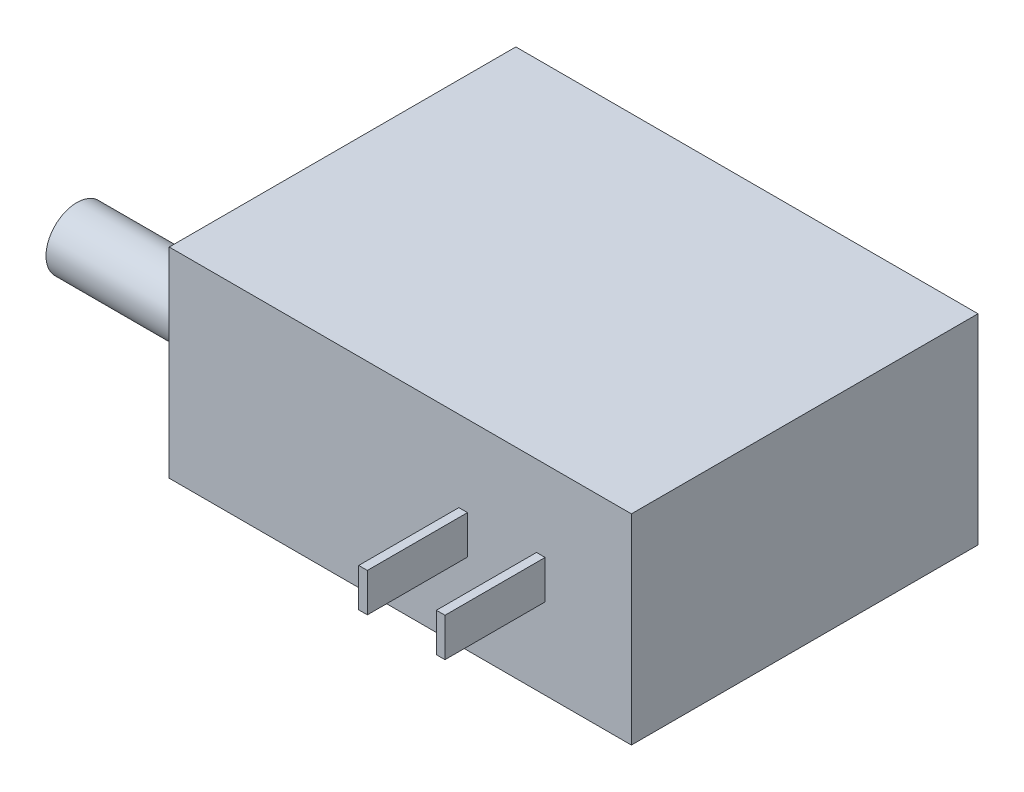
ISO-10303-21;
HEADER;
FILE_DESCRIPTION(('STEP AP214'),'2;1');
FILE_NAME('part.step','',(''),(''),'','','');
FILE_SCHEMA(('AUTOMOTIVE_DESIGN { 1 0 10303 214 1 1 1 1 }'));
ENDSEC;
DATA;
#1=APPLICATION_CONTEXT('core data for automotive mechanical design processes');
#2=APPLICATION_PROTOCOL_DEFINITION('international standard','automotive_design',2000,#1);
#3=PRODUCT_CONTEXT('',#1,'mechanical');
#4=PRODUCT('Part','Part','',(#3));
#5=PRODUCT_RELATED_PRODUCT_CATEGORY('part','',(#4));
#6=PRODUCT_DEFINITION_FORMATION('','',#4);
#7=PRODUCT_DEFINITION_CONTEXT('part definition',#1,'design');
#8=PRODUCT_DEFINITION('design','',#6,#7);
#9=PRODUCT_DEFINITION_SHAPE('','',#8);
#10=(LENGTH_UNIT() NAMED_UNIT(*) SI_UNIT(.MILLI.,.METRE.));
#11=(NAMED_UNIT(*) PLANE_ANGLE_UNIT() SI_UNIT($,.RADIAN.));
#12=(NAMED_UNIT(*) SI_UNIT($,.STERADIAN.) SOLID_ANGLE_UNIT());
#13=UNCERTAINTY_MEASURE_WITH_UNIT(LENGTH_MEASURE(1.E-05),#10,'distance_accuracy_value','');
#14=(GEOMETRIC_REPRESENTATION_CONTEXT(3) GLOBAL_UNCERTAINTY_ASSIGNED_CONTEXT((#13)) GLOBAL_UNIT_ASSIGNED_CONTEXT((#10,
#11,#12)) REPRESENTATION_CONTEXT('',''));
#15=CARTESIAN_POINT('',(0.,0.,0.));
#16=DIRECTION('',(0.,0.,1.));
#17=DIRECTION('',(1.,0.,0.));
#18=AXIS2_PLACEMENT_3D('',#15,#16,#17);
#19=CARTESIAN_POINT('',(-38.1,33.02,28.575));
#20=DIRECTION('',(0.,0.,-1.));
#21=DIRECTION('',(-1.,0.,0.));
#22=AXIS2_PLACEMENT_3D('',#19,#20,#21);
#23=PLANE('',#22);
#24=DIRECTION('',(0.,1.,0.));
#25=VECTOR('',#24,1.);
#26=CARTESIAN_POINT('',(23.876,19.685,28.575));
#27=LINE('',#26,#25);
#28=CARTESIAN_POINT('',(23.876,13.335,28.575));
#29=VERTEX_POINT('',#28);
#30=CARTESIAN_POINT('',(23.876,19.685,28.575));
#31=VERTEX_POINT('',#30);
#32=EDGE_CURVE('E143',#29,#31,#27,.T.);
#33=ORIENTED_EDGE('',*,*,#32,.F.);
#34=DIRECTION('',(1.,0.,0.));
#35=VECTOR('',#34,1.);
#36=CARTESIAN_POINT('',(23.876,13.335,28.575));
#37=LINE('',#36,#35);
#38=CARTESIAN_POINT('',(22.4536,13.335,28.575));
#39=VERTEX_POINT('',#38);
#40=EDGE_CURVE('E156',#39,#29,#37,.T.);
#41=ORIENTED_EDGE('',*,*,#40,.F.);
#42=DIRECTION('',(0.,-1.,0.));
#43=VECTOR('',#42,1.);
#44=CARTESIAN_POINT('',(22.4536,19.685,28.575));
#45=LINE('',#44,#43);
#46=CARTESIAN_POINT('',(22.4536,19.685,28.575));
#47=VERTEX_POINT('',#46);
#48=EDGE_CURVE('E165',#47,#39,#45,.T.);
#49=ORIENTED_EDGE('',*,*,#48,.F.);
#50=DIRECTION('',(-1.,0.,0.));
#51=VECTOR('',#50,1.);
#52=CARTESIAN_POINT('',(23.876,19.685,28.575));
#53=LINE('',#52,#51);
#54=EDGE_CURVE('E146',#31,#47,#53,.T.);
#55=ORIENTED_EDGE('',*,*,#54,.F.);
#56=EDGE_LOOP('',(#33,#41,#49,#55));
#57=FACE_BOUND('',#56,.T.);
#58=DIRECTION('',(1.,0.,0.));
#59=VECTOR('',#58,1.);
#60=CARTESIAN_POINT('',(-38.1,0.,28.575));
#61=LINE('',#60,#59);
#62=CARTESIAN_POINT('',(-38.1,0.,28.575));
#63=VERTEX_POINT('',#62);
#64=CARTESIAN_POINT('',(38.1,0.,28.575));
#65=VERTEX_POINT('',#64);
#66=EDGE_CURVE('E198',#63,#65,#61,.T.);
#67=ORIENTED_EDGE('',*,*,#66,.T.);
#68=DIRECTION('',(0.,-1.,0.));
#69=VECTOR('',#68,1.);
#70=CARTESIAN_POINT('',(38.1,33.02,28.575));
#71=LINE('',#70,#69);
#72=CARTESIAN_POINT('',(38.1,33.02,28.575));
#73=VERTEX_POINT('',#72);
#74=EDGE_CURVE('E208',#73,#65,#71,.T.);
#75=ORIENTED_EDGE('',*,*,#74,.F.);
#76=DIRECTION('',(1.,0.,0.));
#77=VECTOR('',#76,1.);
#78=CARTESIAN_POINT('',(-38.1,33.02,28.575));
#79=LINE('',#78,#77);
#80=CARTESIAN_POINT('',(-38.1,33.02,28.575));
#81=VERTEX_POINT('',#80);
#82=EDGE_CURVE('E188',#81,#73,#79,.T.);
#83=ORIENTED_EDGE('',*,*,#82,.F.);
#84=DIRECTION('',(0.,-1.,0.));
#85=VECTOR('',#84,1.);
#86=CARTESIAN_POINT('',(-38.1,33.02,28.575));
#87=LINE('',#86,#85);
#88=EDGE_CURVE('E41',#81,#63,#87,.T.);
#89=ORIENTED_EDGE('',*,*,#88,.T.);
#90=EDGE_LOOP('',(#67,#75,#83,#89));
#91=FACE_BOUND('',#90,.T.);
#92=DIRECTION('',(0.,1.,0.));
#93=VECTOR('',#92,1.);
#94=CARTESIAN_POINT('',(11.0744,19.685,28.575));
#95=LINE('',#94,#93);
#96=CARTESIAN_POINT('',(11.0744,13.335,28.575));
#97=VERTEX_POINT('',#96);
#98=CARTESIAN_POINT('',(11.0744,19.685,28.575));
#99=VERTEX_POINT('',#98);
#100=EDGE_CURVE('E142',#97,#99,#95,.T.);
#101=ORIENTED_EDGE('',*,*,#100,.F.);
#102=DIRECTION('',(1.,0.,0.));
#103=VECTOR('',#102,1.);
#104=CARTESIAN_POINT('',(11.0744,13.335,28.575));
#105=LINE('',#104,#103);
#106=CARTESIAN_POINT('',(9.65200000000002,13.335,28.575));
#107=VERTEX_POINT('',#106);
#108=EDGE_CURVE('E139',#107,#97,#105,.T.);
#109=ORIENTED_EDGE('',*,*,#108,.F.);
#110=DIRECTION('',(0.,-1.,0.));
#111=VECTOR('',#110,1.);
#112=CARTESIAN_POINT('',(9.65200000000002,19.685,28.575));
#113=LINE('',#112,#111);
#114=CARTESIAN_POINT('',(9.65200000000002,19.685,28.575));
#115=VERTEX_POINT('',#114);
#116=EDGE_CURVE('E53',#115,#107,#113,.T.);
#117=ORIENTED_EDGE('',*,*,#116,.F.);
#118=DIRECTION('',(-1.,0.,0.));
#119=VECTOR('',#118,1.);
#120=CARTESIAN_POINT('',(11.0744,19.685,28.575));
#121=LINE('',#120,#119);
#122=EDGE_CURVE('E48',#99,#115,#121,.T.);
#123=ORIENTED_EDGE('',*,*,#122,.F.);
#124=EDGE_LOOP('',(#101,#109,#117,#123));
#125=FACE_BOUND('',#124,.T.);
#126=ADVANCED_FACE('F33',(#57,#91,#125),#23,.F.);
#127=CARTESIAN_POINT('',(-38.1,33.02,-28.575));
#128=DIRECTION('',(1.,0.,0.));
#129=DIRECTION('',(0.,0.,-1.));
#130=AXIS2_PLACEMENT_3D('',#127,#128,#129);
#131=PLANE('',#130);
#132=DIRECTION('',(0.,0.,1.));
#133=VECTOR('',#132,1.);
#134=CARTESIAN_POINT('',(-38.1,0.,-28.575));
#135=LINE('',#134,#133);
#136=CARTESIAN_POINT('',(-38.1,0.,-28.575));
#137=VERTEX_POINT('',#136);
#138=EDGE_CURVE('E184',#137,#63,#135,.T.);
#139=ORIENTED_EDGE('',*,*,#138,.T.);
#140=ORIENTED_EDGE('',*,*,#88,.F.);
#141=DIRECTION('',(0.,0.,1.));
#142=VECTOR('',#141,1.);
#143=CARTESIAN_POINT('',(-38.1,33.02,-28.575));
#144=LINE('',#143,#142);
#145=CARTESIAN_POINT('',(-38.1,33.02,-28.575));
#146=VERTEX_POINT('',#145);
#147=EDGE_CURVE('E185',#146,#81,#144,.T.);
#148=ORIENTED_EDGE('',*,*,#147,.F.);
#149=DIRECTION('',(0.,-1.,0.));
#150=VECTOR('',#149,1.);
#151=CARTESIAN_POINT('',(-38.1,33.02,-28.575));
#152=LINE('',#151,#150);
#153=EDGE_CURVE('E195',#146,#137,#152,.T.);
#154=ORIENTED_EDGE('',*,*,#153,.T.);
#155=EDGE_LOOP('',(#139,#140,#148,#154));
#156=FACE_BOUND('',#155,.T.);
#157=CARTESIAN_POINT('',(-38.1,16.51,18.415));
#158=DIRECTION('',(1.,0.,0.));
#159=DIRECTION('',(0.,0.,-1.));
#160=AXIS2_PLACEMENT_3D('',#157,#158,#159);
#161=CIRCLE('',#160,5.08);
#162=CARTESIAN_POINT('',(-38.1,16.51,13.335));
#163=VERTEX_POINT('',#162);
#164=EDGE_CURVE('E11',#163,#163,#161,.F.);
#165=ORIENTED_EDGE('',*,*,#164,.F.);
#166=EDGE_LOOP('',(#165));
#167=FACE_BOUND('',#166,.T.);
#168=ADVANCED_FACE('F35',(#156,#167),#131,.F.);
#169=CARTESIAN_POINT('',(38.1,33.02,-28.575));
#170=DIRECTION('',(-1.,0.,0.));
#171=DIRECTION('',(0.,0.,1.));
#172=AXIS2_PLACEMENT_3D('',#169,#170,#171);
#173=PLANE('',#172);
#174=DIRECTION('',(0.,0.,-1.));
#175=VECTOR('',#174,1.);
#176=CARTESIAN_POINT('',(38.1,0.,-28.575));
#177=LINE('',#176,#175);
#178=CARTESIAN_POINT('',(38.1,0.,-28.575));
#179=VERTEX_POINT('',#178);
#180=EDGE_CURVE('E200',#65,#179,#177,.T.);
#181=ORIENTED_EDGE('',*,*,#180,.T.);
#182=DIRECTION('',(0.,-1.,0.));
#183=VECTOR('',#182,1.);
#184=CARTESIAN_POINT('',(38.1,33.02,-28.575));
#185=LINE('',#184,#183);
#186=CARTESIAN_POINT('',(38.1,33.02,-28.575));
#187=VERTEX_POINT('',#186);
#188=EDGE_CURVE('E205',#187,#179,#185,.T.);
#189=ORIENTED_EDGE('',*,*,#188,.F.);
#190=DIRECTION('',(0.,0.,-1.));
#191=VECTOR('',#190,1.);
#192=CARTESIAN_POINT('',(38.1,33.02,-28.575));
#193=LINE('',#192,#191);
#194=EDGE_CURVE('E191',#73,#187,#193,.T.);
#195=ORIENTED_EDGE('',*,*,#194,.F.);
#196=ORIENTED_EDGE('',*,*,#74,.T.);
#197=EDGE_LOOP('',(#181,#189,#195,#196));
#198=FACE_BOUND('',#197,.T.);
#199=ADVANCED_FACE('F225',(#198),#173,.F.);
#200=CARTESIAN_POINT('',(-38.1,33.02,-28.575));
#201=DIRECTION('',(0.,0.,1.));
#202=DIRECTION('',(1.,0.,0.));
#203=AXIS2_PLACEMENT_3D('',#200,#201,#202);
#204=PLANE('',#203);
#205=DIRECTION('',(-1.,0.,0.));
#206=VECTOR('',#205,1.);
#207=CARTESIAN_POINT('',(-38.1,0.,-28.575));
#208=LINE('',#207,#206);
#209=EDGE_CURVE('E189',#179,#137,#208,.T.);
#210=ORIENTED_EDGE('',*,*,#209,.T.);
#211=ORIENTED_EDGE('',*,*,#153,.F.);
#212=DIRECTION('',(-1.,0.,0.));
#213=VECTOR('',#212,1.);
#214=CARTESIAN_POINT('',(-38.1,33.02,-28.575));
#215=LINE('',#214,#213);
#216=EDGE_CURVE('E193',#187,#146,#215,.T.);
#217=ORIENTED_EDGE('',*,*,#216,.F.);
#218=ORIENTED_EDGE('',*,*,#188,.T.);
#219=EDGE_LOOP('',(#210,#211,#217,#218));
#220=FACE_BOUND('',#219,.T.);
#221=ADVANCED_FACE('F229',(#220),#204,.F.);
#222=CARTESIAN_POINT('',(0.,33.02,0.));
#223=DIRECTION('',(0.,1.,0.));
#224=DIRECTION('',(0.,0.,1.));
#225=AXIS2_PLACEMENT_3D('',#222,#223,#224);
#226=PLANE('',#225);
#227=ORIENTED_EDGE('',*,*,#147,.T.);
#228=ORIENTED_EDGE('',*,*,#82,.T.);
#229=ORIENTED_EDGE('',*,*,#194,.T.);
#230=ORIENTED_EDGE('',*,*,#216,.T.);
#231=EDGE_LOOP('',(#227,#228,#229,#230));
#232=FACE_BOUND('',#231,.T.);
#233=ADVANCED_FACE('F231',(#232),#226,.T.);
#234=CARTESIAN_POINT('',(0.,0.,0.));
#235=DIRECTION('',(0.,1.,0.));
#236=DIRECTION('',(0.,0.,1.));
#237=AXIS2_PLACEMENT_3D('',#234,#235,#236);
#238=PLANE('',#237);
#239=ORIENTED_EDGE('',*,*,#138,.F.);
#240=ORIENTED_EDGE('',*,*,#209,.F.);
#241=ORIENTED_EDGE('',*,*,#180,.F.);
#242=ORIENTED_EDGE('',*,*,#66,.F.);
#243=EDGE_LOOP('',(#239,#240,#241,#242));
#244=FACE_BOUND('',#243,.T.);
#245=ADVANCED_FACE('F221',(#244),#238,.F.);
#246=CARTESIAN_POINT('',(-63.5,16.51,18.415));
#247=DIRECTION('',(1.,0.,0.));
#248=DIRECTION('',(0.,0.,-1.));
#249=AXIS2_PLACEMENT_3D('',#246,#247,#248);
#250=CYLINDRICAL_SURFACE('',#249,5.08);
#251=CARTESIAN_POINT('',(-63.5,16.51,18.415));
#252=DIRECTION('',(-1.,0.,0.));
#253=DIRECTION('',(0.,0.,1.));
#254=AXIS2_PLACEMENT_3D('',#251,#252,#253);
#255=CIRCLE('',#254,5.08);
#256=CARTESIAN_POINT('',(-63.5,16.51,23.495));
#257=VERTEX_POINT('',#256);
#258=EDGE_CURVE('E181',#257,#257,#255,.T.);
#259=ORIENTED_EDGE('',*,*,#258,.F.);
#260=EDGE_LOOP('',(#259));
#261=FACE_BOUND('',#260,.T.);
#262=ORIENTED_EDGE('',*,*,#164,.T.);
#263=EDGE_LOOP('',(#262));
#264=FACE_BOUND('',#263,.T.);
#265=ADVANCED_FACE('F238',(#261,#264),#250,.T.);
#266=CARTESIAN_POINT('',(-63.5,16.51,18.415));
#267=DIRECTION('',(-1.,0.,0.));
#268=DIRECTION('',(0.,0.,1.));
#269=AXIS2_PLACEMENT_3D('',#266,#267,#268);
#270=PLANE('',#269);
#271=ORIENTED_EDGE('',*,*,#258,.T.);
#272=EDGE_LOOP('',(#271));
#273=FACE_BOUND('',#272,.T.);
#274=ADVANCED_FACE('F280',(#273),#270,.T.);
#275=CARTESIAN_POINT('',(23.876,19.685,45.085));
#276=DIRECTION('',(-1.,0.,0.));
#277=DIRECTION('',(0.,0.,1.));
#278=AXIS2_PLACEMENT_3D('',#275,#276,#277);
#279=PLANE('',#278);
#280=ORIENTED_EDGE('',*,*,#32,.T.);
#281=DIRECTION('',(0.,0.,-1.));
#282=VECTOR('',#281,1.);
#283=CARTESIAN_POINT('',(23.876,19.685,45.085));
#284=LINE('',#283,#282);
#285=CARTESIAN_POINT('',(23.876,19.685,45.085));
#286=VERTEX_POINT('',#285);
#287=EDGE_CURVE('E178',#286,#31,#284,.T.);
#288=ORIENTED_EDGE('',*,*,#287,.F.);
#289=DIRECTION('',(0.,1.,0.));
#290=VECTOR('',#289,1.);
#291=CARTESIAN_POINT('',(23.876,19.685,45.085));
#292=LINE('',#291,#290);
#293=CARTESIAN_POINT('',(23.876,13.335,45.085));
#294=VERTEX_POINT('',#293);
#295=EDGE_CURVE('E152',#294,#286,#292,.T.);
#296=ORIENTED_EDGE('',*,*,#295,.F.);
#297=DIRECTION('',(0.,0.,-1.));
#298=VECTOR('',#297,1.);
#299=CARTESIAN_POINT('',(23.876,13.335,45.085));
#300=LINE('',#299,#298);
#301=EDGE_CURVE('E161',#294,#29,#300,.T.);
#302=ORIENTED_EDGE('',*,*,#301,.T.);
#303=EDGE_LOOP('',(#280,#288,#296,#302));
#304=FACE_BOUND('',#303,.T.);
#305=ADVANCED_FACE('F288',(#304),#279,.F.);
#306=CARTESIAN_POINT('',(23.876,19.685,45.085));
#307=DIRECTION('',(0.,-1.,0.));
#308=DIRECTION('',(0.,0.,-1.));
#309=AXIS2_PLACEMENT_3D('',#306,#307,#308);
#310=PLANE('',#309);
#311=ORIENTED_EDGE('',*,*,#54,.T.);
#312=DIRECTION('',(0.,0.,-1.));
#313=VECTOR('',#312,1.);
#314=CARTESIAN_POINT('',(22.4536,19.685,45.085));
#315=LINE('',#314,#313);
#316=CARTESIAN_POINT('',(22.4536,19.685,45.085));
#317=VERTEX_POINT('',#316);
#318=EDGE_CURVE('E175',#317,#47,#315,.T.);
#319=ORIENTED_EDGE('',*,*,#318,.F.);
#320=DIRECTION('',(-1.,0.,0.));
#321=VECTOR('',#320,1.);
#322=CARTESIAN_POINT('',(23.876,19.685,45.085));
#323=LINE('',#322,#321);
#324=EDGE_CURVE('E155',#286,#317,#323,.T.);
#325=ORIENTED_EDGE('',*,*,#324,.F.);
#326=ORIENTED_EDGE('',*,*,#287,.T.);
#327=EDGE_LOOP('',(#311,#319,#325,#326));
#328=FACE_BOUND('',#327,.T.);
#329=ADVANCED_FACE('F303',(#328),#310,.F.);
#330=CARTESIAN_POINT('',(22.4536,19.685,45.085));
#331=DIRECTION('',(1.,0.,0.));
#332=DIRECTION('',(0.,0.,-1.));
#333=AXIS2_PLACEMENT_3D('',#330,#331,#332);
#334=PLANE('',#333);
#335=ORIENTED_EDGE('',*,*,#48,.T.);
#336=DIRECTION('',(0.,0.,-1.));
#337=VECTOR('',#336,1.);
#338=CARTESIAN_POINT('',(22.4536,13.335,45.085));
#339=LINE('',#338,#337);
#340=CARTESIAN_POINT('',(22.4536,13.335,45.085));
#341=VERTEX_POINT('',#340);
#342=EDGE_CURVE('E172',#341,#39,#339,.T.);
#343=ORIENTED_EDGE('',*,*,#342,.F.);
#344=DIRECTION('',(0.,-1.,0.));
#345=VECTOR('',#344,1.);
#346=CARTESIAN_POINT('',(22.4536,19.685,45.085));
#347=LINE('',#346,#345);
#348=EDGE_CURVE('E158',#317,#341,#347,.T.);
#349=ORIENTED_EDGE('',*,*,#348,.F.);
#350=ORIENTED_EDGE('',*,*,#318,.T.);
#351=EDGE_LOOP('',(#335,#343,#349,#350));
#352=FACE_BOUND('',#351,.T.);
#353=ADVANCED_FACE('F313',(#352),#334,.F.);
#354=CARTESIAN_POINT('',(23.876,13.335,45.085));
#355=DIRECTION('',(0.,1.,0.));
#356=DIRECTION('',(0.,0.,1.));
#357=AXIS2_PLACEMENT_3D('',#354,#355,#356);
#358=PLANE('',#357);
#359=ORIENTED_EDGE('',*,*,#40,.T.);
#360=ORIENTED_EDGE('',*,*,#301,.F.);
#361=DIRECTION('',(1.,0.,0.));
#362=VECTOR('',#361,1.);
#363=CARTESIAN_POINT('',(23.876,13.335,45.085));
#364=LINE('',#363,#362);
#365=EDGE_CURVE('E160',#341,#294,#364,.T.);
#366=ORIENTED_EDGE('',*,*,#365,.F.);
#367=ORIENTED_EDGE('',*,*,#342,.T.);
#368=EDGE_LOOP('',(#359,#360,#366,#367));
#369=FACE_BOUND('',#368,.T.);
#370=ADVANCED_FACE('F323',(#369),#358,.F.);
#371=CARTESIAN_POINT('',(0.,0.,45.085));
#372=DIRECTION('',(0.,0.,-1.));
#373=DIRECTION('',(-1.,0.,0.));
#374=AXIS2_PLACEMENT_3D('',#371,#372,#373);
#375=PLANE('',#374);
#376=ORIENTED_EDGE('',*,*,#295,.T.);
#377=ORIENTED_EDGE('',*,*,#324,.T.);
#378=ORIENTED_EDGE('',*,*,#348,.T.);
#379=ORIENTED_EDGE('',*,*,#365,.T.);
#380=EDGE_LOOP('',(#376,#377,#378,#379));
#381=FACE_BOUND('',#380,.T.);
#382=ADVANCED_FACE('F333',(#381),#375,.F.);
#383=CARTESIAN_POINT('',(11.0744,19.685,45.085));
#384=DIRECTION('',(-1.,0.,0.));
#385=DIRECTION('',(0.,-1.,0.));
#386=AXIS2_PLACEMENT_3D('',#383,#384,#385);
#387=PLANE('',#386);
#388=ORIENTED_EDGE('',*,*,#100,.T.);
#389=DIRECTION('',(0.,0.,-1.));
#390=VECTOR('',#389,1.);
#391=CARTESIAN_POINT('',(11.0744,19.685,45.085));
#392=LINE('',#391,#390);
#393=CARTESIAN_POINT('',(11.0744,19.685,45.085));
#394=VERTEX_POINT('',#393);
#395=EDGE_CURVE('E123',#394,#99,#392,.T.);
#396=ORIENTED_EDGE('',*,*,#395,.F.);
#397=DIRECTION('',(0.,1.,0.));
#398=VECTOR('',#397,1.);
#399=CARTESIAN_POINT('',(11.0744,19.685,45.085));
#400=LINE('',#399,#398);
#401=CARTESIAN_POINT('',(11.0744,13.335,45.085));
#402=VERTEX_POINT('',#401);
#403=EDGE_CURVE('E130',#402,#394,#400,.T.);
#404=ORIENTED_EDGE('',*,*,#403,.F.);
#405=DIRECTION('',(0.,0.,-1.));
#406=VECTOR('',#405,1.);
#407=CARTESIAN_POINT('',(11.0744,13.335,45.085));
#408=LINE('',#407,#406);
#409=EDGE_CURVE('E393',#402,#97,#408,.T.);
#410=ORIENTED_EDGE('',*,*,#409,.T.);
#411=EDGE_LOOP('',(#388,#396,#404,#410));
#412=FACE_BOUND('',#411,.T.);
#413=ADVANCED_FACE('F141',(#412),#387,.F.);
#414=CARTESIAN_POINT('',(11.0744,19.685,45.085));
#415=DIRECTION('',(0.,-1.,0.));
#416=DIRECTION('',(0.,0.,-1.));
#417=AXIS2_PLACEMENT_3D('',#414,#415,#416);
#418=PLANE('',#417);
#419=ORIENTED_EDGE('',*,*,#122,.T.);
#420=DIRECTION('',(0.,0.,-1.));
#421=VECTOR('',#420,1.);
#422=CARTESIAN_POINT('',(9.65200000000002,19.685,45.085));
#423=LINE('',#422,#421);
#424=CARTESIAN_POINT('',(9.65200000000002,19.685,45.085));
#425=VERTEX_POINT('',#424);
#426=EDGE_CURVE('E126',#425,#115,#423,.T.);
#427=ORIENTED_EDGE('',*,*,#426,.F.);
#428=DIRECTION('',(-1.,0.,0.));
#429=VECTOR('',#428,1.);
#430=CARTESIAN_POINT('',(11.0744,19.685,45.085));
#431=LINE('',#430,#429);
#432=EDGE_CURVE('E119',#394,#425,#431,.T.);
#433=ORIENTED_EDGE('',*,*,#432,.F.);
#434=ORIENTED_EDGE('',*,*,#395,.T.);
#435=EDGE_LOOP('',(#419,#427,#433,#434));
#436=FACE_BOUND('',#435,.T.);
#437=ADVANCED_FACE('F121',(#436),#418,.F.);
#438=CARTESIAN_POINT('',(9.65200000000002,19.685,45.085));
#439=DIRECTION('',(1.,0.,0.));
#440=DIRECTION('',(0.,0.,-1.));
#441=AXIS2_PLACEMENT_3D('',#438,#439,#440);
#442=PLANE('',#441);
#443=ORIENTED_EDGE('',*,*,#116,.T.);
#444=DIRECTION('',(0.,0.,-1.));
#445=VECTOR('',#444,1.);
#446=CARTESIAN_POINT('',(9.65200000000002,13.335,45.085));
#447=LINE('',#446,#445);
#448=CARTESIAN_POINT('',(9.65200000000002,13.335,45.085));
#449=VERTEX_POINT('',#448);
#450=EDGE_CURVE('E148',#449,#107,#447,.T.);
#451=ORIENTED_EDGE('',*,*,#450,.F.);
#452=DIRECTION('',(0.,-1.,0.));
#453=VECTOR('',#452,1.);
#454=CARTESIAN_POINT('',(9.65200000000002,19.685,45.085));
#455=LINE('',#454,#453);
#456=EDGE_CURVE('E129',#425,#449,#455,.T.);
#457=ORIENTED_EDGE('',*,*,#456,.F.);
#458=ORIENTED_EDGE('',*,*,#426,.T.);
#459=EDGE_LOOP('',(#443,#451,#457,#458));
#460=FACE_BOUND('',#459,.T.);
#461=ADVANCED_FACE('F360',(#460),#442,.F.);
#462=CARTESIAN_POINT('',(11.0744,13.335,45.085));
#463=DIRECTION('',(0.,1.,0.));
#464=DIRECTION('',(-1.,0.,0.));
#465=AXIS2_PLACEMENT_3D('',#462,#463,#464);
#466=PLANE('',#465);
#467=ORIENTED_EDGE('',*,*,#108,.T.);
#468=ORIENTED_EDGE('',*,*,#409,.F.);
#469=DIRECTION('',(1.,0.,0.));
#470=VECTOR('',#469,1.);
#471=CARTESIAN_POINT('',(11.0744,13.335,45.085));
#472=LINE('',#471,#470);
#473=EDGE_CURVE('E135',#449,#402,#472,.T.);
#474=ORIENTED_EDGE('',*,*,#473,.F.);
#475=ORIENTED_EDGE('',*,*,#450,.T.);
#476=EDGE_LOOP('',(#467,#468,#474,#475));
#477=FACE_BOUND('',#476,.T.);
#478=ADVANCED_FACE('F369',(#477),#466,.F.);
#479=CARTESIAN_POINT('',(0.,0.,45.085));
#480=DIRECTION('',(0.,0.,-1.));
#481=DIRECTION('',(-1.,0.,0.));
#482=AXIS2_PLACEMENT_3D('',#479,#480,#481);
#483=PLANE('',#482);
#484=ORIENTED_EDGE('',*,*,#403,.T.);
#485=ORIENTED_EDGE('',*,*,#432,.T.);
#486=ORIENTED_EDGE('',*,*,#456,.T.);
#487=ORIENTED_EDGE('',*,*,#473,.T.);
#488=EDGE_LOOP('',(#484,#485,#486,#487));
#489=FACE_BOUND('',#488,.T.);
#490=ADVANCED_FACE('F133',(#489),#483,.F.);
#491=CLOSED_SHELL('',(#126,#168,#199,#221,#233,#245,#265,#274,#305,#329,#353,#370,#382,#413,
#437,#461,#478,#490));
#492=MANIFOLD_SOLID_BREP('B2',#491);
#493=ADVANCED_BREP_SHAPE_REPRESENTATION('',(#18,#492),#14);
#494=SHAPE_DEFINITION_REPRESENTATION(#9,#493);
ENDSEC;
END-ISO-10303-21;
